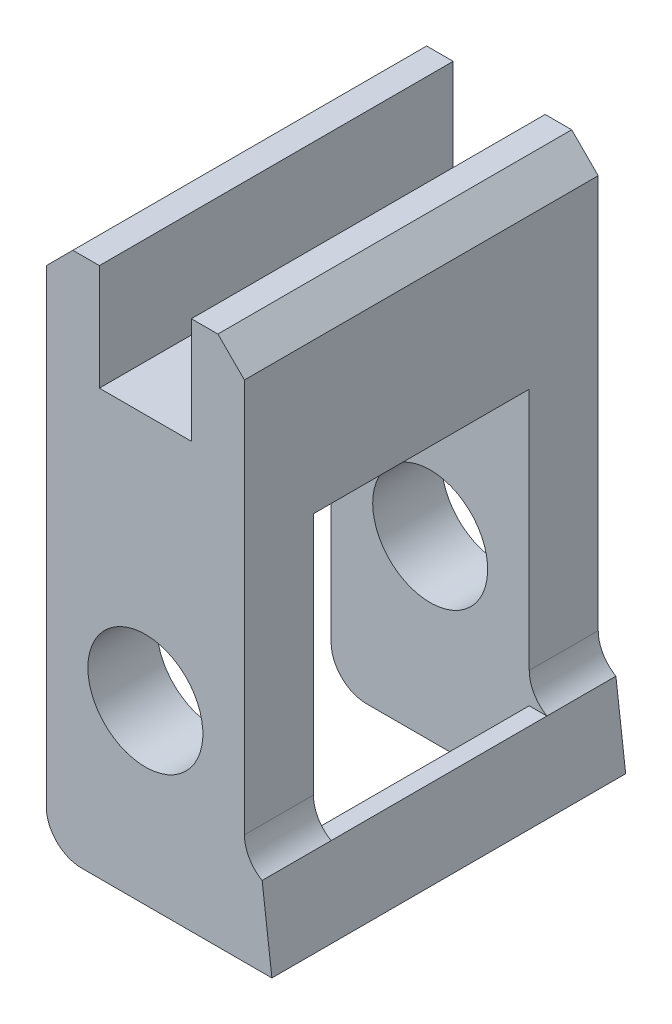
ISO-10303-21;
HEADER;
FILE_DESCRIPTION(('STEP AP214'),'2;1');
FILE_NAME('part.step','',(''),(''),'','','');
FILE_SCHEMA(('AUTOMOTIVE_DESIGN { 1 0 10303 214 1 1 1 1 }'));
ENDSEC;
DATA;
#1=APPLICATION_CONTEXT('core data for automotive mechanical design processes');
#2=APPLICATION_PROTOCOL_DEFINITION('international standard','automotive_design',2000,#1);
#3=PRODUCT_CONTEXT('',#1,'mechanical');
#4=PRODUCT('Part','Part','',(#3));
#5=PRODUCT_RELATED_PRODUCT_CATEGORY('part','',(#4));
#6=PRODUCT_DEFINITION_FORMATION('','',#4);
#7=PRODUCT_DEFINITION_CONTEXT('part definition',#1,'design');
#8=PRODUCT_DEFINITION('design','',#6,#7);
#9=PRODUCT_DEFINITION_SHAPE('','',#8);
#10=(LENGTH_UNIT() NAMED_UNIT(*) SI_UNIT(.MILLI.,.METRE.));
#11=(NAMED_UNIT(*) PLANE_ANGLE_UNIT() SI_UNIT($,.RADIAN.));
#12=(NAMED_UNIT(*) SI_UNIT($,.STERADIAN.) SOLID_ANGLE_UNIT());
#13=UNCERTAINTY_MEASURE_WITH_UNIT(LENGTH_MEASURE(1.E-05),#10,'distance_accuracy_value','');
#14=(GEOMETRIC_REPRESENTATION_CONTEXT(3) GLOBAL_UNCERTAINTY_ASSIGNED_CONTEXT((#13)) GLOBAL_UNIT_ASSIGNED_CONTEXT((#10,
#11,#12)) REPRESENTATION_CONTEXT('',''));
#15=CARTESIAN_POINT('',(0.,0.,0.));
#16=DIRECTION('',(0.,0.,1.));
#17=DIRECTION('',(1.,0.,0.));
#18=AXIS2_PLACEMENT_3D('',#15,#16,#17);
#19=CARTESIAN_POINT('',(11.684,5.71500000000001,32.6812626722529));
#20=DIRECTION('',(0.,1.,0.));
#21=DIRECTION('',(-1.,0.,0.));
#22=AXIS2_PLACEMENT_3D('',#19,#20,#21);
#23=PLANE('',#22);
#24=DIRECTION('',(1.,0.,0.));
#25=VECTOR('',#24,1.);
#26=CARTESIAN_POINT('',(25.4,5.71499999999999,4.953));
#27=LINE('',#26,#25);
#28=CARTESIAN_POINT('',(14.224,5.71500000000001,4.953));
#29=VERTEX_POINT('',#28);
#30=CARTESIAN_POINT('',(15.494,5.715,4.953));
#31=VERTEX_POINT('',#30);
#32=EDGE_CURVE('E56',#29,#31,#27,.T.);
#33=ORIENTED_EDGE('',*,*,#32,.F.);
#34=DIRECTION('',(0.,0.,-1.));
#35=VECTOR('',#34,1.);
#36=CARTESIAN_POINT('',(14.224,5.71500000000001,27.0173830282429));
#37=LINE('',#36,#35);
#38=CARTESIAN_POINT('',(14.224,5.71500000000001,20.447));
#39=VERTEX_POINT('',#38);
#40=EDGE_CURVE('E190',#39,#29,#37,.T.);
#41=ORIENTED_EDGE('',*,*,#40,.F.);
#42=DIRECTION('',(-1.,0.,0.));
#43=VECTOR('',#42,1.);
#44=CARTESIAN_POINT('',(25.4,5.71499999999999,20.447));
#45=LINE('',#44,#43);
#46=CARTESIAN_POINT('',(15.494,5.715,20.447));
#47=VERTEX_POINT('',#46);
#48=EDGE_CURVE('E64',#47,#39,#45,.T.);
#49=ORIENTED_EDGE('',*,*,#48,.F.);
#50=DIRECTION('',(0.,0.,-1.));
#51=VECTOR('',#50,1.);
#52=CARTESIAN_POINT('',(15.494,5.715,32.6812626722529));
#53=LINE('',#52,#51);
#54=EDGE_CURVE('E250',#47,#31,#53,.T.);
#55=ORIENTED_EDGE('',*,*,#54,.T.);
#56=EDGE_LOOP('',(#33,#41,#49,#55));
#57=FACE_BOUND('',#56,.T.);
#58=ADVANCED_FACE('F41',(#57),#23,.T.);
#59=CARTESIAN_POINT('',(2.54,2.54,25.4));
#60=DIRECTION('',(0.,0.,-1.));
#61=DIRECTION('',(-1.,0.,0.));
#62=AXIS2_PLACEMENT_3D('',#59,#60,#61);
#63=CYLINDRICAL_SURFACE('',#62,2.54);
#64=CARTESIAN_POINT('',(2.54,2.54,4.953));
#65=DIRECTION('',(0.,0.,-1.));
#66=DIRECTION('',(0.,1.,0.));
#67=AXIS2_PLACEMENT_3D('',#64,#65,#66);
#68=CIRCLE('',#67,2.54);
#69=CARTESIAN_POINT('',(0.,2.54,4.953));
#70=VERTEX_POINT('',#69);
#71=CARTESIAN_POINT('',(2.54,0.,4.953));
#72=VERTEX_POINT('',#71);
#73=EDGE_CURVE('E304',#70,#72,#68,.F.);
#74=ORIENTED_EDGE('',*,*,#73,.F.);
#75=DIRECTION('',(0.,0.,-1.));
#76=VECTOR('',#75,1.);
#77=CARTESIAN_POINT('',(0.,2.54,25.4));
#78=LINE('',#77,#76);
#79=CARTESIAN_POINT('',(0.,2.54,0.));
#80=VERTEX_POINT('',#79);
#81=EDGE_CURVE('E389',#80,#70,#78,.F.);
#82=ORIENTED_EDGE('',*,*,#81,.F.);
#83=CARTESIAN_POINT('',(2.54,2.54,0.));
#84=DIRECTION('',(0.,0.,-1.));
#85=DIRECTION('',(-1.,0.,0.));
#86=AXIS2_PLACEMENT_3D('',#83,#84,#85);
#87=CIRCLE('',#86,2.54);
#88=CARTESIAN_POINT('',(2.54,0.,0.));
#89=VERTEX_POINT('',#88);
#90=EDGE_CURVE('E384',#89,#80,#87,.T.);
#91=ORIENTED_EDGE('',*,*,#90,.F.);
#92=DIRECTION('',(0.,0.,-1.));
#93=VECTOR('',#92,1.);
#94=CARTESIAN_POINT('',(2.54,0.,25.4));
#95=LINE('',#94,#93);
#96=EDGE_CURVE('E381',#72,#89,#95,.T.);
#97=ORIENTED_EDGE('',*,*,#96,.F.);
#98=EDGE_LOOP('',(#74,#82,#91,#97));
#99=FACE_BOUND('',#98,.T.);
#100=ADVANCED_FACE('F479',(#99),#63,.T.);
#101=CARTESIAN_POINT('',(7.112,12.7,25.4));
#102=DIRECTION('',(0.,0.,-1.));
#103=DIRECTION('',(-1.,0.,0.));
#104=AXIS2_PLACEMENT_3D('',#101,#102,#103);
#105=CYLINDRICAL_SURFACE('',#104,4.1275);
#106=CARTESIAN_POINT('',(7.112,12.7,4.953));
#107=DIRECTION('',(0.,0.,-1.));
#108=DIRECTION('',(0.,1.,0.));
#109=AXIS2_PLACEMENT_3D('',#106,#107,#108);
#110=CIRCLE('',#109,4.1275);
#111=CARTESIAN_POINT('',(7.112,16.8275,4.953));
#112=VERTEX_POINT('',#111);
#113=EDGE_CURVE('E299',#112,#112,#110,.F.);
#114=ORIENTED_EDGE('',*,*,#113,.T.);
#115=EDGE_LOOP('',(#114));
#116=FACE_BOUND('',#115,.T.);
#117=CARTESIAN_POINT('',(7.112,12.7,0.));
#118=DIRECTION('',(0.,0.,-1.));
#119=DIRECTION('',(-1.,0.,0.));
#120=AXIS2_PLACEMENT_3D('',#117,#118,#119);
#121=CIRCLE('',#120,4.1275);
#122=CARTESIAN_POINT('',(2.9845,12.7,0.));
#123=VERTEX_POINT('',#122);
#124=EDGE_CURVE('E315',#123,#123,#121,.T.);
#125=ORIENTED_EDGE('',*,*,#124,.T.);
#126=EDGE_LOOP('',(#125));
#127=FACE_BOUND('',#126,.T.);
#128=ADVANCED_FACE('F516',(#116,#127),#105,.F.);
#129=CARTESIAN_POINT('',(14.224,0.,25.4));
#130=DIRECTION('',(0.,1.,0.));
#131=DIRECTION('',(-1.,0.,0.));
#132=AXIS2_PLACEMENT_3D('',#129,#130,#131);
#133=PLANE('',#132);
#134=DIRECTION('',(0.,0.,-1.));
#135=VECTOR('',#134,1.);
#136=CARTESIAN_POINT('',(14.9257137655601,0.,27.0173830282429));
#137=LINE('',#136,#135);
#138=CARTESIAN_POINT('',(14.9257137655601,0.,20.447));
#139=VERTEX_POINT('',#138);
#140=CARTESIAN_POINT('',(14.9257137655601,0.,4.953));
#141=VERTEX_POINT('',#140);
#142=EDGE_CURVE('E192',#139,#141,#137,.T.);
#143=ORIENTED_EDGE('',*,*,#142,.T.);
#144=DIRECTION('',(-1.,0.,0.));
#145=VECTOR('',#144,1.);
#146=CARTESIAN_POINT('',(25.4,0.,4.953));
#147=LINE('',#146,#145);
#148=EDGE_CURVE('E271',#141,#72,#147,.T.);
#149=ORIENTED_EDGE('',*,*,#148,.T.);
#150=ORIENTED_EDGE('',*,*,#96,.T.);
#151=DIRECTION('',(1.,0.,0.));
#152=VECTOR('',#151,1.);
#153=CARTESIAN_POINT('',(14.224,0.,0.));
#154=LINE('',#153,#152);
#155=CARTESIAN_POINT('',(16.1957137655601,0.,0.));
#156=VERTEX_POINT('',#155);
#157=EDGE_CURVE('E343',#89,#156,#154,.T.);
#158=ORIENTED_EDGE('',*,*,#157,.T.);
#159=DIRECTION('',(0.,0.,-1.));
#160=VECTOR('',#159,1.);
#161=CARTESIAN_POINT('',(16.1957137655601,0.,32.6812626722529));
#162=LINE('',#161,#160);
#163=CARTESIAN_POINT('',(16.1957137655601,0.,25.4));
#164=VERTEX_POINT('',#163);
#165=EDGE_CURVE('E245',#164,#156,#162,.T.);
#166=ORIENTED_EDGE('',*,*,#165,.F.);
#167=DIRECTION('',(1.,0.,0.));
#168=VECTOR('',#167,1.);
#169=CARTESIAN_POINT('',(14.224,0.,25.4));
#170=LINE('',#169,#168);
#171=CARTESIAN_POINT('',(2.54,0.,25.4));
#172=VERTEX_POINT('',#171);
#173=EDGE_CURVE('E316',#172,#164,#170,.T.);
#174=ORIENTED_EDGE('',*,*,#173,.F.);
#175=CARTESIAN_POINT('',(2.54,0.,20.447));
#176=VERTEX_POINT('',#175);
#177=EDGE_CURVE('E279',#172,#176,#95,.T.);
#178=ORIENTED_EDGE('',*,*,#177,.T.);
#179=DIRECTION('',(-1.,0.,0.));
#180=VECTOR('',#179,1.);
#181=CARTESIAN_POINT('',(25.4,0.,20.447));
#182=LINE('',#181,#180);
#183=EDGE_CURVE('E276',#139,#176,#182,.T.);
#184=ORIENTED_EDGE('',*,*,#183,.F.);
#185=EDGE_LOOP('',(#143,#149,#150,#158,#166,#174,#178,#184));
#186=FACE_BOUND('',#185,.T.);
#187=ADVANCED_FACE('F273',(#186),#133,.F.);
#188=CARTESIAN_POINT('',(14.224,38.1,25.4));
#189=DIRECTION('',(-1.,0.,0.));
#190=DIRECTION('',(0.,-1.,0.));
#191=AXIS2_PLACEMENT_3D('',#188,#189,#190);
#192=PLANE('',#191);
#193=DIRECTION('',(0.,1.,0.));
#194=VECTOR('',#193,1.);
#195=CARTESIAN_POINT('',(14.224,38.1,25.4));
#196=LINE('',#195,#194);
#197=CARTESIAN_POINT('',(14.224,7.91470452561248,25.4));
#198=VERTEX_POINT('',#197);
#199=CARTESIAN_POINT('',(14.224,36.195,25.4));
#200=VERTEX_POINT('',#199);
#201=EDGE_CURVE('E319',#198,#200,#196,.T.);
#202=ORIENTED_EDGE('',*,*,#201,.F.);
#203=DIRECTION('',(0.,0.,-1.));
#204=VECTOR('',#203,1.);
#205=CARTESIAN_POINT('',(14.224,7.91470452561247,25.4));
#206=LINE('',#205,#204);
#207=CARTESIAN_POINT('',(14.224,7.91470452561247,20.447));
#208=VERTEX_POINT('',#207);
#209=EDGE_CURVE('E212',#198,#208,#206,.T.);
#210=ORIENTED_EDGE('',*,*,#209,.T.);
#211=DIRECTION('',(0.,1.,0.));
#212=VECTOR('',#211,1.);
#213=CARTESIAN_POINT('',(14.224,38.1,20.447));
#214=LINE('',#213,#212);
#215=CARTESIAN_POINT('',(14.224,25.4,20.447));
#216=VERTEX_POINT('',#215);
#217=EDGE_CURVE('E292',#208,#216,#214,.T.);
#218=ORIENTED_EDGE('',*,*,#217,.T.);
#219=DIRECTION('',(0.,0.,-1.));
#220=VECTOR('',#219,1.);
#221=CARTESIAN_POINT('',(14.224,25.4,25.4));
#222=LINE('',#221,#220);
#223=CARTESIAN_POINT('',(14.224,25.4,4.953));
#224=VERTEX_POINT('',#223);
#225=EDGE_CURVE('E307',#216,#224,#222,.T.);
#226=ORIENTED_EDGE('',*,*,#225,.T.);
#227=DIRECTION('',(0.,-1.,0.));
#228=VECTOR('',#227,1.);
#229=CARTESIAN_POINT('',(14.224,38.1,4.953));
#230=LINE('',#229,#228);
#231=CARTESIAN_POINT('',(14.224,7.91470452561247,4.953));
#232=VERTEX_POINT('',#231);
#233=EDGE_CURVE('E300',#224,#232,#230,.T.);
#234=ORIENTED_EDGE('',*,*,#233,.T.);
#235=DIRECTION('',(0.,0.,-1.));
#236=VECTOR('',#235,1.);
#237=CARTESIAN_POINT('',(14.224,7.91470452561247,25.4));
#238=LINE('',#237,#236);
#239=CARTESIAN_POINT('',(14.224,7.91470452561248,0.));
#240=VERTEX_POINT('',#239);
#241=EDGE_CURVE('E206',#232,#240,#238,.T.);
#242=ORIENTED_EDGE('',*,*,#241,.T.);
#243=DIRECTION('',(0.,1.,0.));
#244=VECTOR('',#243,1.);
#245=CARTESIAN_POINT('',(14.224,38.1,0.));
#246=LINE('',#245,#244);
#247=CARTESIAN_POINT('',(14.224,36.195,0.));
#248=VERTEX_POINT('',#247);
#249=EDGE_CURVE('E235',#240,#248,#246,.T.);
#250=ORIENTED_EDGE('',*,*,#249,.T.);
#251=DIRECTION('',(0.,0.,1.));
#252=VECTOR('',#251,1.);
#253=CARTESIAN_POINT('',(14.224,36.195,25.4));
#254=LINE('',#253,#252);
#255=EDGE_CURVE('E207',#248,#200,#254,.T.);
#256=ORIENTED_EDGE('',*,*,#255,.T.);
#257=EDGE_LOOP('',(#202,#210,#218,#226,#234,#242,#250,#256));
#258=FACE_BOUND('',#257,.T.);
#259=ADVANCED_FACE('F453',(#258),#192,.F.);
#260=CARTESIAN_POINT('',(10.414,38.1,25.4));
#261=DIRECTION('',(0.,-1.,0.));
#262=DIRECTION('',(0.,0.,-1.));
#263=AXIS2_PLACEMENT_3D('',#260,#261,#262);
#264=PLANE('',#263);
#265=DIRECTION('',(-1.,0.,0.));
#266=VECTOR('',#265,1.);
#267=CARTESIAN_POINT('',(10.414,38.1,25.4));
#268=LINE('',#267,#266);
#269=CARTESIAN_POINT('',(12.319,38.1,25.4));
#270=VERTEX_POINT('',#269);
#271=CARTESIAN_POINT('',(10.414,38.1,25.4));
#272=VERTEX_POINT('',#271);
#273=EDGE_CURVE('E323',#270,#272,#268,.T.);
#274=ORIENTED_EDGE('',*,*,#273,.F.);
#275=DIRECTION('',(0.,0.,-1.));
#276=VECTOR('',#275,1.);
#277=CARTESIAN_POINT('',(12.319,38.1,25.4));
#278=LINE('',#277,#276);
#279=CARTESIAN_POINT('',(12.319,38.1,0.));
#280=VERTEX_POINT('',#279);
#281=EDGE_CURVE('E215',#270,#280,#278,.T.);
#282=ORIENTED_EDGE('',*,*,#281,.T.);
#283=DIRECTION('',(-1.,0.,0.));
#284=VECTOR('',#283,1.);
#285=CARTESIAN_POINT('',(10.414,38.1,0.));
#286=LINE('',#285,#284);
#287=CARTESIAN_POINT('',(10.414,38.1,0.));
#288=VERTEX_POINT('',#287);
#289=EDGE_CURVE('E348',#280,#288,#286,.T.);
#290=ORIENTED_EDGE('',*,*,#289,.T.);
#291=DIRECTION('',(0.,0.,-1.));
#292=VECTOR('',#291,1.);
#293=CARTESIAN_POINT('',(10.414,38.1,25.4));
#294=LINE('',#293,#292);
#295=EDGE_CURVE('E377',#272,#288,#294,.T.);
#296=ORIENTED_EDGE('',*,*,#295,.F.);
#297=EDGE_LOOP('',(#274,#282,#290,#296));
#298=FACE_BOUND('',#297,.T.);
#299=ADVANCED_FACE('F429',(#298),#264,.F.);
#300=CARTESIAN_POINT('',(10.414,30.48,25.4));
#301=DIRECTION('',(1.,0.,0.));
#302=DIRECTION('',(0.,1.,0.));
#303=AXIS2_PLACEMENT_3D('',#300,#301,#302);
#304=PLANE('',#303);
#305=DIRECTION('',(0.,-1.,0.));
#306=VECTOR('',#305,1.);
#307=CARTESIAN_POINT('',(10.414,30.48,0.));
#308=LINE('',#307,#306);
#309=CARTESIAN_POINT('',(10.414,30.48,0.));
#310=VERTEX_POINT('',#309);
#311=EDGE_CURVE('E351',#288,#310,#308,.T.);
#312=ORIENTED_EDGE('',*,*,#311,.T.);
#313=DIRECTION('',(0.,0.,-1.));
#314=VECTOR('',#313,1.);
#315=CARTESIAN_POINT('',(10.414,30.48,25.4));
#316=LINE('',#315,#314);
#317=CARTESIAN_POINT('',(10.414,30.48,25.4));
#318=VERTEX_POINT('',#317);
#319=EDGE_CURVE('E373',#318,#310,#316,.T.);
#320=ORIENTED_EDGE('',*,*,#319,.F.);
#321=DIRECTION('',(0.,-1.,0.));
#322=VECTOR('',#321,1.);
#323=CARTESIAN_POINT('',(10.414,30.48,25.4));
#324=LINE('',#323,#322);
#325=EDGE_CURVE('E326',#272,#318,#324,.T.);
#326=ORIENTED_EDGE('',*,*,#325,.F.);
#327=ORIENTED_EDGE('',*,*,#295,.T.);
#328=EDGE_LOOP('',(#312,#320,#326,#327));
#329=FACE_BOUND('',#328,.T.);
#330=ADVANCED_FACE('F439',(#329),#304,.F.);
#331=CARTESIAN_POINT('',(3.81,30.48,25.4));
#332=DIRECTION('',(0.,-1.,0.));
#333=DIRECTION('',(0.,0.,-1.));
#334=AXIS2_PLACEMENT_3D('',#331,#332,#333);
#335=PLANE('',#334);
#336=DIRECTION('',(-1.,0.,0.));
#337=VECTOR('',#336,1.);
#338=CARTESIAN_POINT('',(3.81,30.48,0.));
#339=LINE('',#338,#337);
#340=CARTESIAN_POINT('',(3.81,30.48,0.));
#341=VERTEX_POINT('',#340);
#342=EDGE_CURVE('E354',#310,#341,#339,.T.);
#343=ORIENTED_EDGE('',*,*,#342,.T.);
#344=DIRECTION('',(0.,0.,-1.));
#345=VECTOR('',#344,1.);
#346=CARTESIAN_POINT('',(3.81,30.48,25.4));
#347=LINE('',#346,#345);
#348=CARTESIAN_POINT('',(3.81,30.48,25.4));
#349=VERTEX_POINT('',#348);
#350=EDGE_CURVE('E369',#349,#341,#347,.T.);
#351=ORIENTED_EDGE('',*,*,#350,.F.);
#352=DIRECTION('',(-1.,0.,0.));
#353=VECTOR('',#352,1.);
#354=CARTESIAN_POINT('',(3.81,30.48,25.4));
#355=LINE('',#354,#353);
#356=EDGE_CURVE('E329',#318,#349,#355,.T.);
#357=ORIENTED_EDGE('',*,*,#356,.F.);
#358=ORIENTED_EDGE('',*,*,#319,.T.);
#359=EDGE_LOOP('',(#343,#351,#357,#358));
#360=FACE_BOUND('',#359,.T.);
#361=ADVANCED_FACE('F443',(#360),#335,.F.);
#362=CARTESIAN_POINT('',(3.81,38.1,25.4));
#363=DIRECTION('',(-1.,0.,0.));
#364=DIRECTION('',(0.,-1.,0.));
#365=AXIS2_PLACEMENT_3D('',#362,#363,#364);
#366=PLANE('',#365);
#367=DIRECTION('',(0.,1.,0.));
#368=VECTOR('',#367,1.);
#369=CARTESIAN_POINT('',(3.81,38.1,0.));
#370=LINE('',#369,#368);
#371=CARTESIAN_POINT('',(3.81,38.1,0.));
#372=VERTEX_POINT('',#371);
#373=EDGE_CURVE('E357',#341,#372,#370,.T.);
#374=ORIENTED_EDGE('',*,*,#373,.T.);
#375=DIRECTION('',(0.,0.,-1.));
#376=VECTOR('',#375,1.);
#377=CARTESIAN_POINT('',(3.81,38.1,25.4));
#378=LINE('',#377,#376);
#379=CARTESIAN_POINT('',(3.81,38.1,25.4));
#380=VERTEX_POINT('',#379);
#381=EDGE_CURVE('E342',#380,#372,#378,.T.);
#382=ORIENTED_EDGE('',*,*,#381,.F.);
#383=DIRECTION('',(0.,1.,0.));
#384=VECTOR('',#383,1.);
#385=CARTESIAN_POINT('',(3.81,38.1,25.4));
#386=LINE('',#385,#384);
#387=EDGE_CURVE('E332',#349,#380,#386,.T.);
#388=ORIENTED_EDGE('',*,*,#387,.F.);
#389=ORIENTED_EDGE('',*,*,#350,.T.);
#390=EDGE_LOOP('',(#374,#382,#388,#389));
#391=FACE_BOUND('',#390,.T.);
#392=ADVANCED_FACE('F502',(#391),#366,.F.);
#393=CARTESIAN_POINT('',(0.,38.1,25.4));
#394=DIRECTION('',(0.,-1.,0.));
#395=DIRECTION('',(0.,0.,-1.));
#396=AXIS2_PLACEMENT_3D('',#393,#394,#395);
#397=PLANE('',#396);
#398=DIRECTION('',(-1.,0.,0.));
#399=VECTOR('',#398,1.);
#400=CARTESIAN_POINT('',(0.,38.1,0.));
#401=LINE('',#400,#399);
#402=CARTESIAN_POINT('',(1.905,38.1,0.));
#403=VERTEX_POINT('',#402);
#404=EDGE_CURVE('E360',#372,#403,#401,.T.);
#405=ORIENTED_EDGE('',*,*,#404,.T.);
#406=DIRECTION('',(0.,0.,1.));
#407=VECTOR('',#406,1.);
#408=CARTESIAN_POINT('',(1.905,38.1,25.4));
#409=LINE('',#408,#407);
#410=CARTESIAN_POINT('',(1.905,38.1,25.4));
#411=VERTEX_POINT('',#410);
#412=EDGE_CURVE('E415',#403,#411,#409,.T.);
#413=ORIENTED_EDGE('',*,*,#412,.T.);
#414=DIRECTION('',(-1.,0.,0.));
#415=VECTOR('',#414,1.);
#416=CARTESIAN_POINT('',(0.,38.1,25.4));
#417=LINE('',#416,#415);
#418=EDGE_CURVE('E335',#380,#411,#417,.T.);
#419=ORIENTED_EDGE('',*,*,#418,.F.);
#420=ORIENTED_EDGE('',*,*,#381,.T.);
#421=EDGE_LOOP('',(#405,#413,#419,#420));
#422=FACE_BOUND('',#421,.T.);
#423=ADVANCED_FACE('F500',(#422),#397,.F.);
#424=CARTESIAN_POINT('',(0.,0.,25.4));
#425=DIRECTION('',(1.,0.,0.));
#426=DIRECTION('',(0.,0.,-1.));
#427=AXIS2_PLACEMENT_3D('',#424,#425,#426);
#428=PLANE('',#427);
#429=DIRECTION('',(0.,-1.,0.));
#430=VECTOR('',#429,1.);
#431=CARTESIAN_POINT('',(0.,0.,25.4));
#432=LINE('',#431,#430);
#433=CARTESIAN_POINT('',(0.,36.195,25.4));
#434=VERTEX_POINT('',#433);
#435=CARTESIAN_POINT('',(0.,2.54,25.4));
#436=VERTEX_POINT('',#435);
#437=EDGE_CURVE('E339',#434,#436,#432,.T.);
#438=ORIENTED_EDGE('',*,*,#437,.F.);
#439=DIRECTION('',(0.,0.,-1.));
#440=VECTOR('',#439,1.);
#441=CARTESIAN_POINT('',(0.,36.195,25.4));
#442=LINE('',#441,#440);
#443=CARTESIAN_POINT('',(0.,36.195,0.));
#444=VERTEX_POINT('',#443);
#445=EDGE_CURVE('E396',#434,#444,#442,.T.);
#446=ORIENTED_EDGE('',*,*,#445,.T.);
#447=DIRECTION('',(0.,-1.,0.));
#448=VECTOR('',#447,1.);
#449=CARTESIAN_POINT('',(0.,0.,0.));
#450=LINE('',#449,#448);
#451=EDGE_CURVE('E320',#444,#80,#450,.T.);
#452=ORIENTED_EDGE('',*,*,#451,.T.);
#453=ORIENTED_EDGE('',*,*,#81,.T.);
#454=DIRECTION('',(0.,-1.,0.));
#455=VECTOR('',#454,1.);
#456=CARTESIAN_POINT('',(0.,0.,4.953));
#457=LINE('',#456,#455);
#458=CARTESIAN_POINT('',(0.,25.4,4.953));
#459=VERTEX_POINT('',#458);
#460=EDGE_CURVE('E471',#459,#70,#457,.T.);
#461=ORIENTED_EDGE('',*,*,#460,.F.);
#462=DIRECTION('',(0.,0.,-1.));
#463=VECTOR('',#462,1.);
#464=CARTESIAN_POINT('',(0.,25.4,4.953));
#465=LINE('',#464,#463);
#466=CARTESIAN_POINT('',(0.,25.4,20.447));
#467=VERTEX_POINT('',#466);
#468=EDGE_CURVE('E288',#467,#459,#465,.T.);
#469=ORIENTED_EDGE('',*,*,#468,.F.);
#470=DIRECTION('',(0.,1.,0.));
#471=VECTOR('',#470,1.);
#472=CARTESIAN_POINT('',(0.,0.,20.447));
#473=LINE('',#472,#471);
#474=CARTESIAN_POINT('',(0.,2.54,20.447));
#475=VERTEX_POINT('',#474);
#476=EDGE_CURVE('E467',#475,#467,#473,.T.);
#477=ORIENTED_EDGE('',*,*,#476,.F.);
#478=EDGE_CURVE('E388',#475,#436,#78,.F.);
#479=ORIENTED_EDGE('',*,*,#478,.T.);
#480=EDGE_LOOP('',(#438,#446,#452,#453,#461,#469,#477,#479));
#481=FACE_BOUND('',#480,.T.);
#482=ADVANCED_FACE('F482',(#481),#428,.F.);
#483=CARTESIAN_POINT('',(0.,0.,25.4));
#484=DIRECTION('',(0.,0.,-1.));
#485=DIRECTION('',(-1.,0.,0.));
#486=AXIS2_PLACEMENT_3D('',#483,#484,#485);
#487=PLANE('',#486);
#488=DIRECTION('',(-0.121869343405141,0.992546151641323,0.));
#489=VECTOR('',#488,1.);
#490=CARTESIAN_POINT('',(15.494,5.715,25.4));
#491=LINE('',#490,#489);
#492=CARTESIAN_POINT('',(15.494,5.715,25.4));
#493=VERTEX_POINT('',#492);
#494=EDGE_CURVE('E262',#164,#493,#491,.T.);
#495=ORIENTED_EDGE('',*,*,#494,.T.);
#496=CARTESIAN_POINT('',(16.764,7.91470452561247,25.4));
#497=DIRECTION('',(0.,0.,-1.));
#498=DIRECTION('',(-1.,0.,0.));
#499=AXIS2_PLACEMENT_3D('',#496,#497,#498);
#500=CIRCLE('',#499,2.54);
#501=EDGE_CURVE('E224',#493,#198,#500,.T.);
#502=ORIENTED_EDGE('',*,*,#501,.T.);
#503=ORIENTED_EDGE('',*,*,#201,.T.);
#504=DIRECTION('',(0.707106781186545,-0.70710678118655,0.));
#505=VECTOR('',#504,1.);
#506=CARTESIAN_POINT('',(12.319,38.1,25.4));
#507=LINE('',#506,#505);
#508=EDGE_CURVE('E418',#200,#270,#507,.F.);
#509=ORIENTED_EDGE('',*,*,#508,.T.);
#510=ORIENTED_EDGE('',*,*,#273,.T.);
#511=ORIENTED_EDGE('',*,*,#325,.T.);
#512=ORIENTED_EDGE('',*,*,#356,.T.);
#513=ORIENTED_EDGE('',*,*,#387,.T.);
#514=ORIENTED_EDGE('',*,*,#418,.T.);
#515=DIRECTION('',(0.70710678118655,0.707106781186545,0.));
#516=VECTOR('',#515,1.);
#517=CARTESIAN_POINT('',(0.,36.195,25.4));
#518=LINE('',#517,#516);
#519=EDGE_CURVE('E421',#411,#434,#518,.F.);
#520=ORIENTED_EDGE('',*,*,#519,.T.);
#521=ORIENTED_EDGE('',*,*,#437,.T.);
#522=CARTESIAN_POINT('',(2.54,2.54,25.4));
#523=DIRECTION('',(0.,0.,-1.));
#524=DIRECTION('',(-1.,0.,0.));
#525=AXIS2_PLACEMENT_3D('',#522,#523,#524);
#526=CIRCLE('',#525,2.54);
#527=EDGE_CURVE('E393',#436,#172,#526,.F.);
#528=ORIENTED_EDGE('',*,*,#527,.T.);
#529=ORIENTED_EDGE('',*,*,#173,.T.);
#530=EDGE_LOOP('',(#495,#502,#503,#509,#510,#511,#512,#513,#514,#520,#521,#528,#529));
#531=FACE_BOUND('',#530,.T.);
#532=CARTESIAN_POINT('',(7.112,12.7,25.4));
#533=DIRECTION('',(0.,0.,-1.));
#534=DIRECTION('',(-1.,0.,0.));
#535=AXIS2_PLACEMENT_3D('',#532,#533,#534);
#536=CIRCLE('',#535,4.1275);
#537=CARTESIAN_POINT('',(2.9845,12.7,25.4));
#538=VERTEX_POINT('',#537);
#539=EDGE_CURVE('E311',#538,#538,#536,.T.);
#540=ORIENTED_EDGE('',*,*,#539,.T.);
#541=EDGE_LOOP('',(#540));
#542=FACE_BOUND('',#541,.T.);
#543=ADVANCED_FACE('F447',(#531,#542),#487,.F.);
#544=CARTESIAN_POINT('',(0.,0.,0.));
#545=DIRECTION('',(0.,0.,-1.));
#546=DIRECTION('',(-1.,0.,0.));
#547=AXIS2_PLACEMENT_3D('',#544,#545,#546);
#548=PLANE('',#547);
#549=DIRECTION('',(0.121869343405141,-0.992546151641323,0.));
#550=VECTOR('',#549,1.);
#551=CARTESIAN_POINT('',(15.494,5.715,0.));
#552=LINE('',#551,#550);
#553=CARTESIAN_POINT('',(15.494,5.715,0.));
#554=VERTEX_POINT('',#553);
#555=EDGE_CURVE('E195',#554,#156,#552,.T.);
#556=ORIENTED_EDGE('',*,*,#555,.T.);
#557=ORIENTED_EDGE('',*,*,#157,.F.);
#558=ORIENTED_EDGE('',*,*,#90,.T.);
#559=ORIENTED_EDGE('',*,*,#451,.F.);
#560=DIRECTION('',(-0.70710678118655,-0.707106781186545,0.));
#561=VECTOR('',#560,1.);
#562=CARTESIAN_POINT('',(-18.0975,18.0975000000001,0.));
#563=LINE('',#562,#561);
#564=EDGE_CURVE('E412',#444,#403,#563,.F.);
#565=ORIENTED_EDGE('',*,*,#564,.T.);
#566=ORIENTED_EDGE('',*,*,#404,.F.);
#567=ORIENTED_EDGE('',*,*,#373,.F.);
#568=ORIENTED_EDGE('',*,*,#342,.F.);
#569=ORIENTED_EDGE('',*,*,#311,.F.);
#570=ORIENTED_EDGE('',*,*,#289,.F.);
#571=DIRECTION('',(-0.707106781186545,0.70710678118655,0.));
#572=VECTOR('',#571,1.);
#573=CARTESIAN_POINT('',(25.2095,25.2094999999999,0.));
#574=LINE('',#573,#572);
#575=EDGE_CURVE('E409',#280,#248,#574,.F.);
#576=ORIENTED_EDGE('',*,*,#575,.T.);
#577=ORIENTED_EDGE('',*,*,#249,.F.);
#578=CARTESIAN_POINT('',(16.764,7.91470452561247,0.));
#579=DIRECTION('',(0.,0.,-1.));
#580=DIRECTION('',(-1.,0.,0.));
#581=AXIS2_PLACEMENT_3D('',#578,#579,#580);
#582=CIRCLE('',#581,2.54);
#583=EDGE_CURVE('E50',#240,#554,#582,.F.);
#584=ORIENTED_EDGE('',*,*,#583,.T.);
#585=EDGE_LOOP('',(#556,#557,#558,#559,#565,#566,#567,#568,#569,#570,#576,#577,#584));
#586=FACE_BOUND('',#585,.T.);
#587=ORIENTED_EDGE('',*,*,#124,.F.);
#588=EDGE_LOOP('',(#587));
#589=FACE_BOUND('',#588,.T.);
#590=ADVANCED_FACE('F231',(#586,#589),#548,.T.);
#591=CARTESIAN_POINT('',(2.54,2.54,20.447));
#592=DIRECTION('',(0.,0.,1.));
#593=DIRECTION('',(0.,-1.,0.));
#594=AXIS2_PLACEMENT_3D('',#591,#592,#593);
#595=CIRCLE('',#594,2.54);
#596=EDGE_CURVE('E295',#176,#475,#595,.F.);
#597=ORIENTED_EDGE('',*,*,#596,.F.);
#598=ORIENTED_EDGE('',*,*,#177,.F.);
#599=ORIENTED_EDGE('',*,*,#527,.F.);
#600=ORIENTED_EDGE('',*,*,#478,.F.);
#601=EDGE_LOOP('',(#597,#598,#599,#600));
#602=FACE_BOUND('',#601,.T.);
#603=ADVANCED_FACE('F492',(#602),#63,.T.);
#604=CARTESIAN_POINT('',(7.112,12.7,20.447));
#605=DIRECTION('',(0.,0.,1.));
#606=DIRECTION('',(0.,-1.,0.));
#607=AXIS2_PLACEMENT_3D('',#604,#605,#606);
#608=CIRCLE('',#607,4.1275);
#609=CARTESIAN_POINT('',(7.112,8.5725,20.447));
#610=VERTEX_POINT('',#609);
#611=EDGE_CURVE('E296',#610,#610,#608,.F.);
#612=ORIENTED_EDGE('',*,*,#611,.T.);
#613=EDGE_LOOP('',(#612));
#614=FACE_BOUND('',#613,.T.);
#615=ORIENTED_EDGE('',*,*,#539,.F.);
#616=EDGE_LOOP('',(#615));
#617=FACE_BOUND('',#616,.T.);
#618=ADVANCED_FACE('F523',(#614,#617),#105,.F.);
#619=CARTESIAN_POINT('',(25.4,25.4,4.953));
#620=DIRECTION('',(0.,1.,0.));
#621=DIRECTION('',(-1.,0.,0.));
#622=AXIS2_PLACEMENT_3D('',#619,#620,#621);
#623=PLANE('',#622);
#624=DIRECTION('',(-1.,0.,0.));
#625=VECTOR('',#624,1.);
#626=CARTESIAN_POINT('',(25.4,25.4,20.447));
#627=LINE('',#626,#625);
#628=EDGE_CURVE('E282',#216,#467,#627,.T.);
#629=ORIENTED_EDGE('',*,*,#628,.T.);
#630=ORIENTED_EDGE('',*,*,#468,.T.);
#631=DIRECTION('',(-1.,0.,0.));
#632=VECTOR('',#631,1.);
#633=CARTESIAN_POINT('',(25.4,25.4,4.953));
#634=LINE('',#633,#632);
#635=EDGE_CURVE('E286',#224,#459,#634,.T.);
#636=ORIENTED_EDGE('',*,*,#635,.F.);
#637=ORIENTED_EDGE('',*,*,#225,.F.);
#638=EDGE_LOOP('',(#629,#630,#636,#637));
#639=FACE_BOUND('',#638,.T.);
#640=ADVANCED_FACE('F459',(#639),#623,.F.);
#641=CARTESIAN_POINT('',(25.4,0.,4.953));
#642=DIRECTION('',(0.,0.,-1.));
#643=DIRECTION('',(0.,1.,0.));
#644=AXIS2_PLACEMENT_3D('',#641,#642,#643);
#645=PLANE('',#644);
#646=DIRECTION('',(-0.121869343405141,0.992546151641323,0.));
#647=VECTOR('',#646,1.);
#648=CARTESIAN_POINT('',(14.224,5.71500000000001,4.953));
#649=LINE('',#648,#647);
#650=EDGE_CURVE('E198',#141,#29,#649,.T.);
#651=ORIENTED_EDGE('',*,*,#650,.T.);
#652=ORIENTED_EDGE('',*,*,#32,.T.);
#653=CARTESIAN_POINT('',(16.764,7.91470452561247,4.953));
#654=DIRECTION('',(0.,0.,-1.));
#655=DIRECTION('',(0.,1.,0.));
#656=AXIS2_PLACEMENT_3D('',#653,#654,#655);
#657=CIRCLE('',#656,2.54);
#658=EDGE_CURVE('E11',#31,#232,#657,.T.);
#659=ORIENTED_EDGE('',*,*,#658,.T.);
#660=ORIENTED_EDGE('',*,*,#233,.F.);
#661=ORIENTED_EDGE('',*,*,#635,.T.);
#662=ORIENTED_EDGE('',*,*,#460,.T.);
#663=ORIENTED_EDGE('',*,*,#73,.T.);
#664=ORIENTED_EDGE('',*,*,#148,.F.);
#665=EDGE_LOOP('',(#651,#652,#659,#660,#661,#662,#663,#664));
#666=FACE_BOUND('',#665,.T.);
#667=ORIENTED_EDGE('',*,*,#113,.F.);
#668=EDGE_LOOP('',(#667));
#669=FACE_BOUND('',#668,.T.);
#670=ADVANCED_FACE('F268',(#666,#669),#645,.F.);
#671=CARTESIAN_POINT('',(25.4,0.,20.447));
#672=DIRECTION('',(0.,0.,1.));
#673=DIRECTION('',(0.,-1.,0.));
#674=AXIS2_PLACEMENT_3D('',#671,#672,#673);
#675=PLANE('',#674);
#676=ORIENTED_EDGE('',*,*,#217,.F.);
#677=CARTESIAN_POINT('',(16.764,7.91470452561247,20.447));
#678=DIRECTION('',(0.,0.,1.));
#679=DIRECTION('',(0.,-1.,0.));
#680=AXIS2_PLACEMENT_3D('',#677,#678,#679);
#681=CIRCLE('',#680,2.54);
#682=EDGE_CURVE('E203',#208,#47,#681,.T.);
#683=ORIENTED_EDGE('',*,*,#682,.T.);
#684=ORIENTED_EDGE('',*,*,#48,.T.);
#685=DIRECTION('',(-0.121869343405141,0.992546151641323,0.));
#686=VECTOR('',#685,1.);
#687=CARTESIAN_POINT('',(14.224,5.715,20.447));
#688=LINE('',#687,#686);
#689=EDGE_CURVE('E187',#139,#39,#688,.T.);
#690=ORIENTED_EDGE('',*,*,#689,.F.);
#691=ORIENTED_EDGE('',*,*,#183,.T.);
#692=ORIENTED_EDGE('',*,*,#596,.T.);
#693=ORIENTED_EDGE('',*,*,#476,.T.);
#694=ORIENTED_EDGE('',*,*,#628,.F.);
#695=EDGE_LOOP('',(#676,#683,#684,#690,#691,#692,#693,#694));
#696=FACE_BOUND('',#695,.T.);
#697=ORIENTED_EDGE('',*,*,#611,.F.);
#698=EDGE_LOOP('',(#697));
#699=FACE_BOUND('',#698,.T.);
#700=ADVANCED_FACE('F201',(#696,#699),#675,.F.);
#701=CARTESIAN_POINT('',(0.,36.195,25.4));
#702=DIRECTION('',(0.707106781186545,-0.70710678118655,0.));
#703=DIRECTION('',(0.,0.,-1.));
#704=AXIS2_PLACEMENT_3D('',#701,#702,#703);
#705=PLANE('',#704);
#706=ORIENTED_EDGE('',*,*,#519,.F.);
#707=ORIENTED_EDGE('',*,*,#412,.F.);
#708=ORIENTED_EDGE('',*,*,#564,.F.);
#709=ORIENTED_EDGE('',*,*,#445,.F.);
#710=EDGE_LOOP('',(#706,#707,#708,#709));
#711=FACE_BOUND('',#710,.T.);
#712=ADVANCED_FACE('F497',(#711),#705,.F.);
#713=CARTESIAN_POINT('',(12.319,38.1,25.4));
#714=DIRECTION('',(-0.70710678118655,-0.707106781186545,0.));
#715=DIRECTION('',(0.,0.,-1.));
#716=AXIS2_PLACEMENT_3D('',#713,#714,#715);
#717=PLANE('',#716);
#718=ORIENTED_EDGE('',*,*,#508,.F.);
#719=ORIENTED_EDGE('',*,*,#255,.F.);
#720=ORIENTED_EDGE('',*,*,#575,.F.);
#721=ORIENTED_EDGE('',*,*,#281,.F.);
#722=EDGE_LOOP('',(#718,#719,#720,#721));
#723=FACE_BOUND('',#722,.T.);
#724=ADVANCED_FACE('F451',(#723),#717,.F.);
#725=CARTESIAN_POINT('',(15.494,5.715,32.6812626722529));
#726=DIRECTION('',(0.992546151641323,0.121869343405141,0.));
#727=DIRECTION('',(-0.121869343405141,0.992546151641323,0.));
#728=AXIS2_PLACEMENT_3D('',#725,#726,#727);
#729=PLANE('',#728);
#730=ORIENTED_EDGE('',*,*,#494,.F.);
#731=ORIENTED_EDGE('',*,*,#165,.T.);
#732=ORIENTED_EDGE('',*,*,#555,.F.);
#733=EDGE_CURVE('E243',#31,#554,#53,.T.);
#734=ORIENTED_EDGE('',*,*,#733,.F.);
#735=ORIENTED_EDGE('',*,*,#54,.F.);
#736=EDGE_CURVE('E252',#493,#47,#53,.T.);
#737=ORIENTED_EDGE('',*,*,#736,.F.);
#738=EDGE_LOOP('',(#730,#731,#732,#734,#735,#737));
#739=FACE_BOUND('',#738,.T.);
#740=ADVANCED_FACE('F242',(#739),#729,.T.);
#741=CARTESIAN_POINT('',(16.764,7.91470452561247,32.6812626722529));
#742=DIRECTION('',(0.,0.,-1.));
#743=DIRECTION('',(-1.,0.,0.));
#744=AXIS2_PLACEMENT_3D('',#741,#742,#743);
#745=CYLINDRICAL_SURFACE('',#744,2.54);
#746=ORIENTED_EDGE('',*,*,#501,.F.);
#747=ORIENTED_EDGE('',*,*,#736,.T.);
#748=ORIENTED_EDGE('',*,*,#682,.F.);
#749=ORIENTED_EDGE('',*,*,#209,.F.);
#750=EDGE_LOOP('',(#746,#747,#748,#749));
#751=FACE_BOUND('',#750,.T.);
#752=ADVANCED_FACE('F592',(#751),#745,.F.);
#753=CARTESIAN_POINT('',(16.764,7.91470452561247,32.6812626722529));
#754=DIRECTION('',(0.,0.,-1.));
#755=DIRECTION('',(-1.,0.,0.));
#756=AXIS2_PLACEMENT_3D('',#753,#754,#755);
#757=CYLINDRICAL_SURFACE('',#756,2.54);
#758=ORIENTED_EDGE('',*,*,#658,.F.);
#759=ORIENTED_EDGE('',*,*,#733,.T.);
#760=ORIENTED_EDGE('',*,*,#583,.F.);
#761=ORIENTED_EDGE('',*,*,#241,.F.);
#762=EDGE_LOOP('',(#758,#759,#760,#761));
#763=FACE_BOUND('',#762,.T.);
#764=ADVANCED_FACE('F43',(#763),#757,.F.);
#765=CARTESIAN_POINT('',(14.224,5.71500000000001,27.0173830282429));
#766=DIRECTION('',(-0.992546151641323,-0.121869343405141,0.));
#767=DIRECTION('',(0.121869343405141,-0.992546151641323,0.));
#768=AXIS2_PLACEMENT_3D('',#765,#766,#767);
#769=PLANE('',#768);
#770=ORIENTED_EDGE('',*,*,#689,.T.);
#771=ORIENTED_EDGE('',*,*,#40,.T.);
#772=ORIENTED_EDGE('',*,*,#650,.F.);
#773=ORIENTED_EDGE('',*,*,#142,.F.);
#774=EDGE_LOOP('',(#770,#771,#772,#773));
#775=FACE_BOUND('',#774,.T.);
#776=ADVANCED_FACE('F188',(#775),#769,.T.);
#777=CLOSED_SHELL('',(#58,#100,#128,#187,#259,#299,#330,#361,#392,#423,#482,#543,#590,#603,#618,
#640,#670,#700,#712,#724,#740,#752,#764,#776));
#778=MANIFOLD_SOLID_BREP('B2',#777);
#779=ADVANCED_BREP_SHAPE_REPRESENTATION('',(#18,#778),#14);
#780=SHAPE_DEFINITION_REPRESENTATION(#9,#779);
ENDSEC;
END-ISO-10303-21;
